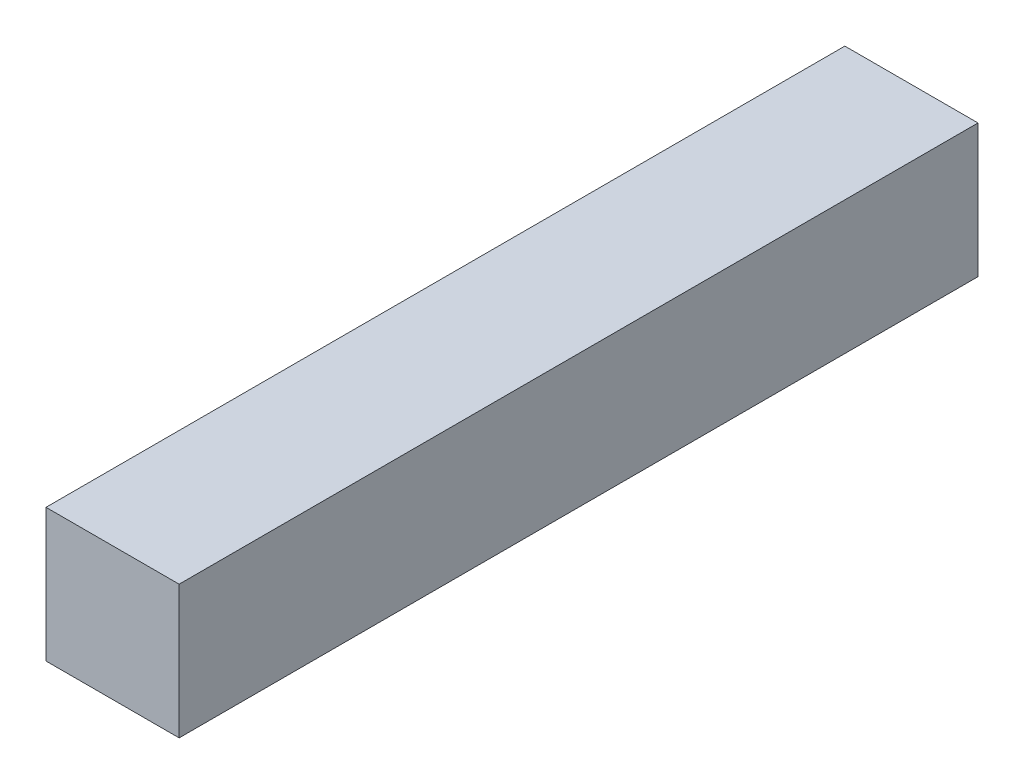
ISO-10303-21;
HEADER;
FILE_DESCRIPTION(('STEP AP214'),'2;1');
FILE_NAME('part.step','',(''),(''),'','','');
FILE_SCHEMA(('AUTOMOTIVE_DESIGN { 1 0 10303 214 1 1 1 1 }'));
ENDSEC;
DATA;
#1=APPLICATION_CONTEXT('core data for automotive mechanical design processes');
#2=APPLICATION_PROTOCOL_DEFINITION('international standard','automotive_design',2000,#1);
#3=PRODUCT_CONTEXT('',#1,'mechanical');
#4=PRODUCT('Part','Part','',(#3));
#5=PRODUCT_RELATED_PRODUCT_CATEGORY('part','',(#4));
#6=PRODUCT_DEFINITION_FORMATION('','',#4);
#7=PRODUCT_DEFINITION_CONTEXT('part definition',#1,'design');
#8=PRODUCT_DEFINITION('design','',#6,#7);
#9=PRODUCT_DEFINITION_SHAPE('','',#8);
#10=(LENGTH_UNIT() NAMED_UNIT(*) SI_UNIT(.MILLI.,.METRE.));
#11=(NAMED_UNIT(*) PLANE_ANGLE_UNIT() SI_UNIT($,.RADIAN.));
#12=(NAMED_UNIT(*) SI_UNIT($,.STERADIAN.) SOLID_ANGLE_UNIT());
#13=UNCERTAINTY_MEASURE_WITH_UNIT(LENGTH_MEASURE(1.E-05),#10,'distance_accuracy_value','');
#14=(GEOMETRIC_REPRESENTATION_CONTEXT(3) GLOBAL_UNCERTAINTY_ASSIGNED_CONTEXT((#13)) GLOBAL_UNIT_ASSIGNED_CONTEXT((#10,
#11,#12)) REPRESENTATION_CONTEXT('',''));
#15=CARTESIAN_POINT('',(0.,0.,0.));
#16=DIRECTION('',(0.,0.,1.));
#17=DIRECTION('',(1.,0.,0.));
#18=AXIS2_PLACEMENT_3D('',#15,#16,#17);
#19=CARTESIAN_POINT('',(0.,0.,90.));
#20=DIRECTION('',(1.,0.,0.));
#21=DIRECTION('',(0.,1.,0.));
#22=AXIS2_PLACEMENT_3D('',#19,#20,#21);
#23=PLANE('',#22);
#24=DIRECTION('',(0.,-1.,0.));
#25=VECTOR('',#24,1.);
#26=CARTESIAN_POINT('',(0.,0.,0.));
#27=LINE('',#26,#25);
#28=CARTESIAN_POINT('',(0.,15.,0.));
#29=VERTEX_POINT('',#28);
#30=CARTESIAN_POINT('',(0.,0.,0.));
#31=VERTEX_POINT('',#30);
#32=EDGE_CURVE('E107',#29,#31,#27,.T.);
#33=ORIENTED_EDGE('',*,*,#32,.T.);
#34=DIRECTION('',(0.,0.,-1.));
#35=VECTOR('',#34,1.);
#36=CARTESIAN_POINT('',(0.,0.,90.));
#37=LINE('',#36,#35);
#38=CARTESIAN_POINT('',(0.,0.,90.));
#39=VERTEX_POINT('',#38);
#40=EDGE_CURVE('E11',#39,#31,#37,.T.);
#41=ORIENTED_EDGE('',*,*,#40,.F.);
#42=DIRECTION('',(0.,-1.,0.));
#43=VECTOR('',#42,1.);
#44=CARTESIAN_POINT('',(0.,0.,90.));
#45=LINE('',#44,#43);
#46=CARTESIAN_POINT('',(0.,15.,90.));
#47=VERTEX_POINT('',#46);
#48=EDGE_CURVE('E91',#47,#39,#45,.T.);
#49=ORIENTED_EDGE('',*,*,#48,.F.);
#50=DIRECTION('',(0.,0.,-1.));
#51=VECTOR('',#50,1.);
#52=CARTESIAN_POINT('',(0.,15.,90.));
#53=LINE('',#52,#51);
#54=EDGE_CURVE('E103',#47,#29,#53,.T.);
#55=ORIENTED_EDGE('',*,*,#54,.T.);
#56=EDGE_LOOP('',(#33,#41,#49,#55));
#57=FACE_BOUND('',#56,.T.);
#58=ADVANCED_FACE('F39',(#57),#23,.F.);
#59=CARTESIAN_POINT('',(0.,0.,90.));
#60=DIRECTION('',(0.,1.,0.));
#61=DIRECTION('',(0.,0.,1.));
#62=AXIS2_PLACEMENT_3D('',#59,#60,#61);
#63=PLANE('',#62);
#64=DIRECTION('',(1.,0.,0.));
#65=VECTOR('',#64,1.);
#66=CARTESIAN_POINT('',(0.,0.,0.));
#67=LINE('',#66,#65);
#68=CARTESIAN_POINT('',(15.,0.,0.));
#69=VERTEX_POINT('',#68);
#70=EDGE_CURVE('E96',#31,#69,#67,.T.);
#71=ORIENTED_EDGE('',*,*,#70,.T.);
#72=DIRECTION('',(0.,0.,-1.));
#73=VECTOR('',#72,1.);
#74=CARTESIAN_POINT('',(15.,0.,90.));
#75=LINE('',#74,#73);
#76=CARTESIAN_POINT('',(15.,0.,90.));
#77=VERTEX_POINT('',#76);
#78=EDGE_CURVE('E48',#77,#69,#75,.T.);
#79=ORIENTED_EDGE('',*,*,#78,.F.);
#80=DIRECTION('',(1.,0.,0.));
#81=VECTOR('',#80,1.);
#82=CARTESIAN_POINT('',(0.,0.,90.));
#83=LINE('',#82,#81);
#84=EDGE_CURVE('E86',#39,#77,#83,.T.);
#85=ORIENTED_EDGE('',*,*,#84,.F.);
#86=ORIENTED_EDGE('',*,*,#40,.T.);
#87=EDGE_LOOP('',(#71,#79,#85,#86));
#88=FACE_BOUND('',#87,.T.);
#89=ADVANCED_FACE('F95',(#88),#63,.F.);
#90=CARTESIAN_POINT('',(15.,0.,90.));
#91=DIRECTION('',(-1.,0.,0.));
#92=DIRECTION('',(0.,0.,1.));
#93=AXIS2_PLACEMENT_3D('',#90,#91,#92);
#94=PLANE('',#93);
#95=DIRECTION('',(0.,1.,0.));
#96=VECTOR('',#95,1.);
#97=CARTESIAN_POINT('',(15.,0.,0.));
#98=LINE('',#97,#96);
#99=CARTESIAN_POINT('',(15.,15.,0.));
#100=VERTEX_POINT('',#99);
#101=EDGE_CURVE('E73',#69,#100,#98,.T.);
#102=ORIENTED_EDGE('',*,*,#101,.T.);
#103=DIRECTION('',(0.,0.,-1.));
#104=VECTOR('',#103,1.);
#105=CARTESIAN_POINT('',(15.,15.,90.));
#106=LINE('',#105,#104);
#107=CARTESIAN_POINT('',(15.,15.,90.));
#108=VERTEX_POINT('',#107);
#109=EDGE_CURVE('E98',#108,#100,#106,.T.);
#110=ORIENTED_EDGE('',*,*,#109,.F.);
#111=DIRECTION('',(0.,1.,0.));
#112=VECTOR('',#111,1.);
#113=CARTESIAN_POINT('',(15.,0.,90.));
#114=LINE('',#113,#112);
#115=EDGE_CURVE('E89',#77,#108,#114,.T.);
#116=ORIENTED_EDGE('',*,*,#115,.F.);
#117=ORIENTED_EDGE('',*,*,#78,.T.);
#118=EDGE_LOOP('',(#102,#110,#116,#117));
#119=FACE_BOUND('',#118,.T.);
#120=ADVANCED_FACE('F99',(#119),#94,.F.);
#121=CARTESIAN_POINT('',(0.,15.,90.));
#122=DIRECTION('',(0.,-1.,0.));
#123=DIRECTION('',(0.,0.,-1.));
#124=AXIS2_PLACEMENT_3D('',#121,#122,#123);
#125=PLANE('',#124);
#126=DIRECTION('',(-1.,0.,0.));
#127=VECTOR('',#126,1.);
#128=CARTESIAN_POINT('',(0.,15.,0.));
#129=LINE('',#128,#127);
#130=EDGE_CURVE('E79',#100,#29,#129,.T.);
#131=ORIENTED_EDGE('',*,*,#130,.T.);
#132=ORIENTED_EDGE('',*,*,#54,.F.);
#133=DIRECTION('',(-1.,0.,0.));
#134=VECTOR('',#133,1.);
#135=CARTESIAN_POINT('',(0.,15.,90.));
#136=LINE('',#135,#134);
#137=EDGE_CURVE('E56',#108,#47,#136,.T.);
#138=ORIENTED_EDGE('',*,*,#137,.F.);
#139=ORIENTED_EDGE('',*,*,#109,.T.);
#140=EDGE_LOOP('',(#131,#132,#138,#139));
#141=FACE_BOUND('',#140,.T.);
#142=ADVANCED_FACE('F120',(#141),#125,.F.);
#143=CARTESIAN_POINT('',(0.,0.,90.));
#144=DIRECTION('',(0.,0.,-1.));
#145=DIRECTION('',(-1.,0.,0.));
#146=AXIS2_PLACEMENT_3D('',#143,#144,#145);
#147=PLANE('',#146);
#148=ORIENTED_EDGE('',*,*,#48,.T.);
#149=ORIENTED_EDGE('',*,*,#84,.T.);
#150=ORIENTED_EDGE('',*,*,#115,.T.);
#151=ORIENTED_EDGE('',*,*,#137,.T.);
#152=EDGE_LOOP('',(#148,#149,#150,#151));
#153=FACE_BOUND('',#152,.T.);
#154=ADVANCED_FACE('F87',(#153),#147,.F.);
#155=CARTESIAN_POINT('',(0.,0.,0.));
#156=DIRECTION('',(0.,0.,-1.));
#157=DIRECTION('',(-1.,0.,0.));
#158=AXIS2_PLACEMENT_3D('',#155,#156,#157);
#159=PLANE('',#158);
#160=ORIENTED_EDGE('',*,*,#32,.F.);
#161=ORIENTED_EDGE('',*,*,#130,.F.);
#162=ORIENTED_EDGE('',*,*,#101,.F.);
#163=ORIENTED_EDGE('',*,*,#70,.F.);
#164=EDGE_LOOP('',(#160,#161,#162,#163));
#165=FACE_BOUND('',#164,.T.);
#166=ADVANCED_FACE('F123',(#165),#159,.T.);
#167=CLOSED_SHELL('',(#58,#89,#120,#142,#154,#166));
#168=MANIFOLD_SOLID_BREP('B2',#167);
#169=ADVANCED_BREP_SHAPE_REPRESENTATION('',(#18,#168),#14);
#170=SHAPE_DEFINITION_REPRESENTATION(#9,#169);
ENDSEC;
END-ISO-10303-21;
